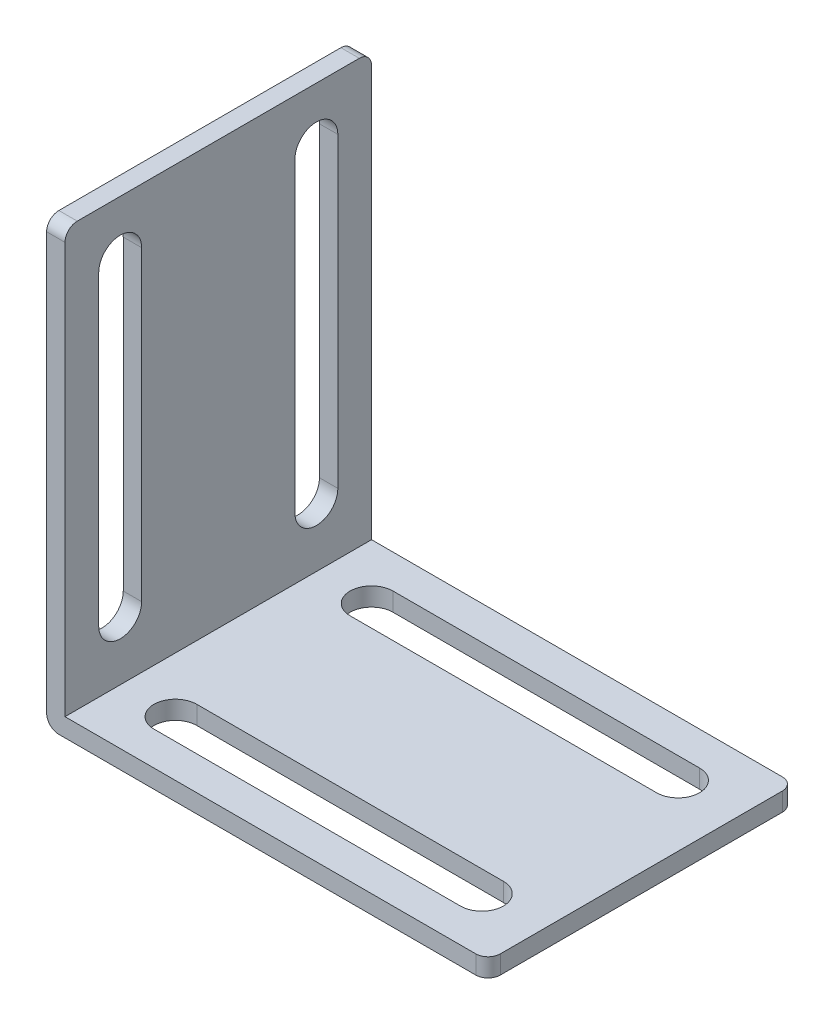
ISO-10303-21;
HEADER;
FILE_DESCRIPTION(('STEP AP214'),'2;1');
FILE_NAME('part.step','',(''),(''),'','','');
FILE_SCHEMA(('AUTOMOTIVE_DESIGN { 1 0 10303 214 1 1 1 1 }'));
ENDSEC;
DATA;
#1=APPLICATION_CONTEXT('core data for automotive mechanical design processes');
#2=APPLICATION_PROTOCOL_DEFINITION('international standard','automotive_design',2000,#1);
#3=PRODUCT_CONTEXT('',#1,'mechanical');
#4=PRODUCT('Part','Part','',(#3));
#5=PRODUCT_RELATED_PRODUCT_CATEGORY('part','',(#4));
#6=PRODUCT_DEFINITION_FORMATION('','',#4);
#7=PRODUCT_DEFINITION_CONTEXT('part definition',#1,'design');
#8=PRODUCT_DEFINITION('design','',#6,#7);
#9=PRODUCT_DEFINITION_SHAPE('','',#8);
#10=(LENGTH_UNIT() NAMED_UNIT(*) SI_UNIT(.MILLI.,.METRE.));
#11=(NAMED_UNIT(*) PLANE_ANGLE_UNIT() SI_UNIT($,.RADIAN.));
#12=(NAMED_UNIT(*) SI_UNIT($,.STERADIAN.) SOLID_ANGLE_UNIT());
#13=UNCERTAINTY_MEASURE_WITH_UNIT(LENGTH_MEASURE(1.E-05),#10,'distance_accuracy_value','');
#14=(GEOMETRIC_REPRESENTATION_CONTEXT(3) GLOBAL_UNCERTAINTY_ASSIGNED_CONTEXT((#13)) GLOBAL_UNIT_ASSIGNED_CONTEXT((#10,
#11,#12)) REPRESENTATION_CONTEXT('',''));
#15=CARTESIAN_POINT('',(0.,0.,0.));
#16=DIRECTION('',(0.,0.,1.));
#17=DIRECTION('',(1.,0.,0.));
#18=AXIS2_PLACEMENT_3D('',#15,#16,#17);
#19=CARTESIAN_POINT('',(0.,0.,0.));
#20=DIRECTION('',(0.,-1.,0.));
#21=DIRECTION('',(0.,0.,-1.));
#22=AXIS2_PLACEMENT_3D('',#19,#20,#21);
#23=PLANE('',#22);
#24=DIRECTION('',(1.,0.,0.));
#25=VECTOR('',#24,1.);
#26=CARTESIAN_POINT('',(0.,0.,-2.75));
#27=LINE('',#26,#25);
#28=CARTESIAN_POINT('',(6.,0.,-2.75));
#29=VERTEX_POINT('',#28);
#30=CARTESIAN_POINT('',(31.,0.,-2.75));
#31=VERTEX_POINT('',#30);
#32=EDGE_CURVE('E324',#29,#31,#27,.T.);
#33=ORIENTED_EDGE('',*,*,#32,.T.);
#34=CARTESIAN_POINT('',(31.,0.,-4.5));
#35=DIRECTION('',(0.,1.,0.));
#36=DIRECTION('',(0.,0.,1.));
#37=AXIS2_PLACEMENT_3D('',#34,#35,#36);
#38=CIRCLE('',#37,1.75);
#39=CARTESIAN_POINT('',(31.,0.,-6.25));
#40=VERTEX_POINT('',#39);
#41=EDGE_CURVE('E327',#31,#40,#38,.T.);
#42=ORIENTED_EDGE('',*,*,#41,.T.);
#43=DIRECTION('',(1.,0.,0.));
#44=VECTOR('',#43,1.);
#45=CARTESIAN_POINT('',(0.,0.,-6.25));
#46=LINE('',#45,#44);
#47=CARTESIAN_POINT('',(6.,0.,-6.25));
#48=VERTEX_POINT('',#47);
#49=EDGE_CURVE('E331',#48,#40,#46,.T.);
#50=ORIENTED_EDGE('',*,*,#49,.F.);
#51=CARTESIAN_POINT('',(6.,0.,-4.5));
#52=DIRECTION('',(0.,1.,0.));
#53=DIRECTION('',(0.,0.,1.));
#54=AXIS2_PLACEMENT_3D('',#51,#52,#53);
#55=CIRCLE('',#54,1.75);
#56=EDGE_CURVE('E334',#48,#29,#55,.T.);
#57=ORIENTED_EDGE('',*,*,#56,.T.);
#58=EDGE_LOOP('',(#33,#42,#50,#57));
#59=FACE_BOUND('',#58,.T.);
#60=DIRECTION('',(-1.,0.,0.));
#61=VECTOR('',#60,1.);
#62=CARTESIAN_POINT('',(0.,0.,-25.));
#63=LINE('',#62,#61);
#64=CARTESIAN_POINT('',(35.,0.,-25.));
#65=VERTEX_POINT('',#64);
#66=CARTESIAN_POINT('',(1.,0.,-25.));
#67=VERTEX_POINT('',#66);
#68=EDGE_CURVE('E412',#65,#67,#63,.T.);
#69=ORIENTED_EDGE('',*,*,#68,.F.);
#70=CARTESIAN_POINT('',(35.,0.,-24.));
#71=DIRECTION('',(0.,-1.,0.));
#72=DIRECTION('',(0.,0.,-1.));
#73=AXIS2_PLACEMENT_3D('',#70,#71,#72);
#74=CIRCLE('',#73,1.);
#75=CARTESIAN_POINT('',(36.,0.,-24.));
#76=VERTEX_POINT('',#75);
#77=EDGE_CURVE('E459',#65,#76,#74,.T.);
#78=ORIENTED_EDGE('',*,*,#77,.T.);
#79=DIRECTION('',(0.,0.,-1.));
#80=VECTOR('',#79,1.);
#81=CARTESIAN_POINT('',(36.,0.,0.));
#82=LINE('',#81,#80);
#83=CARTESIAN_POINT('',(36.,0.,-1.));
#84=VERTEX_POINT('',#83);
#85=EDGE_CURVE('E415',#84,#76,#82,.T.);
#86=ORIENTED_EDGE('',*,*,#85,.F.);
#87=CARTESIAN_POINT('',(35.,0.,-1.));
#88=DIRECTION('',(0.,-1.,0.));
#89=DIRECTION('',(0.,0.,-1.));
#90=AXIS2_PLACEMENT_3D('',#87,#88,#89);
#91=CIRCLE('',#90,1.);
#92=CARTESIAN_POINT('',(35.,0.,0.));
#93=VERTEX_POINT('',#92);
#94=EDGE_CURVE('E457',#84,#93,#91,.T.);
#95=ORIENTED_EDGE('',*,*,#94,.T.);
#96=DIRECTION('',(1.,0.,0.));
#97=VECTOR('',#96,1.);
#98=CARTESIAN_POINT('',(0.,0.,0.));
#99=LINE('',#98,#97);
#100=CARTESIAN_POINT('',(1.,0.,0.));
#101=VERTEX_POINT('',#100);
#102=EDGE_CURVE('E405',#101,#93,#99,.T.);
#103=ORIENTED_EDGE('',*,*,#102,.F.);
#104=DIRECTION('',(0.,0.,1.));
#105=VECTOR('',#104,1.);
#106=CARTESIAN_POINT('',(1.,0.,-25.));
#107=LINE('',#106,#105);
#108=EDGE_CURVE('E455',#101,#67,#107,.F.);
#109=ORIENTED_EDGE('',*,*,#108,.T.);
#110=EDGE_LOOP('',(#69,#78,#86,#95,#103,#109));
#111=FACE_BOUND('',#110,.T.);
#112=CARTESIAN_POINT('',(30.9999999999999,0.,-20.5));
#113=DIRECTION('',(0.,1.,0.));
#114=DIRECTION('',(0.,0.,1.));
#115=AXIS2_PLACEMENT_3D('',#112,#113,#114);
#116=CIRCLE('',#115,1.75);
#117=CARTESIAN_POINT('',(30.9999999999999,0.,-18.75));
#118=VERTEX_POINT('',#117);
#119=CARTESIAN_POINT('',(30.9999999999999,0.,-22.25));
#120=VERTEX_POINT('',#119);
#121=EDGE_CURVE('E383',#118,#120,#116,.T.);
#122=ORIENTED_EDGE('',*,*,#121,.T.);
#123=DIRECTION('',(1.,0.,0.));
#124=VECTOR('',#123,1.);
#125=CARTESIAN_POINT('',(0.,0.,-22.25));
#126=LINE('',#125,#124);
#127=CARTESIAN_POINT('',(5.99999999999994,0.,-22.25));
#128=VERTEX_POINT('',#127);
#129=EDGE_CURVE('E366',#128,#120,#126,.T.);
#130=ORIENTED_EDGE('',*,*,#129,.F.);
#131=CARTESIAN_POINT('',(5.99999999999994,0.,-20.5));
#132=DIRECTION('',(0.,1.,0.));
#133=DIRECTION('',(0.,0.,1.));
#134=AXIS2_PLACEMENT_3D('',#131,#132,#133);
#135=CIRCLE('',#134,1.75);
#136=CARTESIAN_POINT('',(5.99999999999994,0.,-18.75));
#137=VERTEX_POINT('',#136);
#138=EDGE_CURVE('E360',#128,#137,#135,.T.);
#139=ORIENTED_EDGE('',*,*,#138,.T.);
#140=DIRECTION('',(1.,0.,0.));
#141=VECTOR('',#140,1.);
#142=CARTESIAN_POINT('',(0.,0.,-18.75));
#143=LINE('',#142,#141);
#144=EDGE_CURVE('E377',#137,#118,#143,.T.);
#145=ORIENTED_EDGE('',*,*,#144,.T.);
#146=EDGE_LOOP('',(#122,#130,#139,#145));
#147=FACE_BOUND('',#146,.T.);
#148=ADVANCED_FACE('F75',(#59,#111,#147),#23,.T.);
#149=CARTESIAN_POINT('',(0.,1.49999999999999,0.));
#150=DIRECTION('',(0.,1.,0.));
#151=DIRECTION('',(0.,0.,1.));
#152=AXIS2_PLACEMENT_3D('',#149,#150,#151);
#153=PLANE('',#152);
#154=DIRECTION('',(1.,0.,0.));
#155=VECTOR('',#154,1.);
#156=CARTESIAN_POINT('',(0.,1.49999999999999,-2.75));
#157=LINE('',#156,#155);
#158=CARTESIAN_POINT('',(6.,1.49999999999999,-2.75));
#159=VERTEX_POINT('',#158);
#160=CARTESIAN_POINT('',(31.,1.49999999999999,-2.75));
#161=VERTEX_POINT('',#160);
#162=EDGE_CURVE('E338',#159,#161,#157,.T.);
#163=ORIENTED_EDGE('',*,*,#162,.F.);
#164=CARTESIAN_POINT('',(6.,1.49999999999999,-4.5));
#165=DIRECTION('',(0.,1.,0.));
#166=DIRECTION('',(0.,0.,1.));
#167=AXIS2_PLACEMENT_3D('',#164,#165,#166);
#168=CIRCLE('',#167,1.75);
#169=CARTESIAN_POINT('',(6.,1.49999999999999,-6.25));
#170=VERTEX_POINT('',#169);
#171=EDGE_CURVE('E328',#170,#159,#168,.T.);
#172=ORIENTED_EDGE('',*,*,#171,.F.);
#173=DIRECTION('',(1.,0.,0.));
#174=VECTOR('',#173,1.);
#175=CARTESIAN_POINT('',(0.,1.49999999999999,-6.25));
#176=LINE('',#175,#174);
#177=CARTESIAN_POINT('',(31.,1.49999999999999,-6.25));
#178=VERTEX_POINT('',#177);
#179=EDGE_CURVE('E344',#170,#178,#176,.T.);
#180=ORIENTED_EDGE('',*,*,#179,.T.);
#181=CARTESIAN_POINT('',(31.,1.49999999999999,-4.5));
#182=DIRECTION('',(0.,1.,0.));
#183=DIRECTION('',(0.,0.,1.));
#184=AXIS2_PLACEMENT_3D('',#181,#182,#183);
#185=CIRCLE('',#184,1.75);
#186=EDGE_CURVE('E340',#161,#178,#185,.T.);
#187=ORIENTED_EDGE('',*,*,#186,.F.);
#188=EDGE_LOOP('',(#163,#172,#180,#187));
#189=FACE_BOUND('',#188,.T.);
#190=DIRECTION('',(0.,0.,-1.));
#191=VECTOR('',#190,1.);
#192=CARTESIAN_POINT('',(36.,1.49999999999999,-25.));
#193=LINE('',#192,#191);
#194=CARTESIAN_POINT('',(36.,1.49999999999999,-1.));
#195=VERTEX_POINT('',#194);
#196=CARTESIAN_POINT('',(36.,1.49999999999999,-24.));
#197=VERTEX_POINT('',#196);
#198=EDGE_CURVE('E394',#195,#197,#193,.T.);
#199=ORIENTED_EDGE('',*,*,#198,.T.);
#200=CARTESIAN_POINT('',(35.,1.49999999999999,-24.));
#201=DIRECTION('',(0.,1.,0.));
#202=DIRECTION('',(0.,0.,1.));
#203=AXIS2_PLACEMENT_3D('',#200,#201,#202);
#204=CIRCLE('',#203,1.);
#205=CARTESIAN_POINT('',(35.,1.49999999999999,-25.));
#206=VERTEX_POINT('',#205);
#207=EDGE_CURVE('E14',#197,#206,#204,.T.);
#208=ORIENTED_EDGE('',*,*,#207,.T.);
#209=DIRECTION('',(-1.,0.,0.));
#210=VECTOR('',#209,1.);
#211=CARTESIAN_POINT('',(1.5,1.49999999999999,-25.));
#212=LINE('',#211,#210);
#213=CARTESIAN_POINT('',(1.5,1.49999999999999,-25.));
#214=VERTEX_POINT('',#213);
#215=EDGE_CURVE('E397',#206,#214,#212,.T.);
#216=ORIENTED_EDGE('',*,*,#215,.T.);
#217=DIRECTION('',(0.,0.,1.));
#218=VECTOR('',#217,1.);
#219=CARTESIAN_POINT('',(1.5,1.49999999999999,-25.));
#220=LINE('',#219,#218);
#221=CARTESIAN_POINT('',(1.5,1.49999999999999,0.));
#222=VERTEX_POINT('',#221);
#223=EDGE_CURVE('E388',#214,#222,#220,.T.);
#224=ORIENTED_EDGE('',*,*,#223,.T.);
#225=DIRECTION('',(1.,0.,0.));
#226=VECTOR('',#225,1.);
#227=CARTESIAN_POINT('',(1.5,1.49999999999999,0.));
#228=LINE('',#227,#226);
#229=CARTESIAN_POINT('',(35.,1.49999999999999,0.));
#230=VERTEX_POINT('',#229);
#231=EDGE_CURVE('E391',#222,#230,#228,.T.);
#232=ORIENTED_EDGE('',*,*,#231,.T.);
#233=CARTESIAN_POINT('',(35.,1.49999999999999,-1.));
#234=DIRECTION('',(0.,1.,0.));
#235=DIRECTION('',(0.,0.,1.));
#236=AXIS2_PLACEMENT_3D('',#233,#234,#235);
#237=CIRCLE('',#236,1.);
#238=EDGE_CURVE('E83',#230,#195,#237,.T.);
#239=ORIENTED_EDGE('',*,*,#238,.T.);
#240=EDGE_LOOP('',(#199,#208,#216,#224,#232,#239));
#241=FACE_BOUND('',#240,.T.);
#242=CARTESIAN_POINT('',(5.99999999999994,1.49999999999999,-20.5));
#243=DIRECTION('',(0.,1.,0.));
#244=DIRECTION('',(0.,0.,1.));
#245=AXIS2_PLACEMENT_3D('',#242,#243,#244);
#246=CIRCLE('',#245,1.75);
#247=CARTESIAN_POINT('',(5.99999999999994,1.49999999999999,-22.25));
#248=VERTEX_POINT('',#247);
#249=CARTESIAN_POINT('',(5.99999999999994,1.49999999999999,-18.75));
#250=VERTEX_POINT('',#249);
#251=EDGE_CURVE('E341',#248,#250,#246,.T.);
#252=ORIENTED_EDGE('',*,*,#251,.F.);
#253=DIRECTION('',(1.,0.,0.));
#254=VECTOR('',#253,1.);
#255=CARTESIAN_POINT('',(0.,1.49999999999999,-22.25));
#256=LINE('',#255,#254);
#257=CARTESIAN_POINT('',(30.9999999999999,1.49999999999999,-22.25));
#258=VERTEX_POINT('',#257);
#259=EDGE_CURVE('E373',#248,#258,#256,.T.);
#260=ORIENTED_EDGE('',*,*,#259,.T.);
#261=CARTESIAN_POINT('',(30.9999999999999,1.49999999999999,-20.5));
#262=DIRECTION('',(0.,1.,0.));
#263=DIRECTION('',(0.,0.,1.));
#264=AXIS2_PLACEMENT_3D('',#261,#262,#263);
#265=CIRCLE('',#264,1.75);
#266=CARTESIAN_POINT('',(30.9999999999999,1.49999999999999,-18.75));
#267=VERTEX_POINT('',#266);
#268=EDGE_CURVE('E376',#267,#258,#265,.T.);
#269=ORIENTED_EDGE('',*,*,#268,.F.);
#270=DIRECTION('',(1.,0.,0.));
#271=VECTOR('',#270,1.);
#272=CARTESIAN_POINT('',(0.,1.49999999999999,-18.75));
#273=LINE('',#272,#271);
#274=EDGE_CURVE('E363',#250,#267,#273,.T.);
#275=ORIENTED_EDGE('',*,*,#274,.F.);
#276=EDGE_LOOP('',(#252,#260,#269,#275));
#277=FACE_BOUND('',#276,.T.);
#278=ADVANCED_FACE('F468',(#189,#241,#277),#153,.T.);
#279=CARTESIAN_POINT('',(36.,36.,0.));
#280=DIRECTION('',(-1.,0.,0.));
#281=DIRECTION('',(0.,0.,1.));
#282=AXIS2_PLACEMENT_3D('',#279,#280,#281);
#283=PLANE('',#282);
#284=ORIENTED_EDGE('',*,*,#85,.T.);
#285=DIRECTION('',(0.,-1.,0.));
#286=VECTOR('',#285,1.);
#287=CARTESIAN_POINT('',(36.,36.,-24.));
#288=LINE('',#287,#286);
#289=EDGE_CURVE('E464',#76,#197,#288,.F.);
#290=ORIENTED_EDGE('',*,*,#289,.T.);
#291=ORIENTED_EDGE('',*,*,#198,.F.);
#292=DIRECTION('',(0.,-1.,0.));
#293=VECTOR('',#292,1.);
#294=CARTESIAN_POINT('',(36.,36.,-1.));
#295=LINE('',#294,#293);
#296=EDGE_CURVE('E461',#195,#84,#295,.T.);
#297=ORIENTED_EDGE('',*,*,#296,.T.);
#298=EDGE_LOOP('',(#284,#290,#291,#297));
#299=FACE_BOUND('',#298,.T.);
#300=ADVANCED_FACE('F476',(#299),#283,.F.);
#301=CARTESIAN_POINT('',(0.,36.,0.));
#302=DIRECTION('',(1.,0.,0.));
#303=DIRECTION('',(0.,0.,-1.));
#304=AXIS2_PLACEMENT_3D('',#301,#302,#303);
#305=PLANE('',#304);
#306=DIRECTION('',(0.,-1.,0.));
#307=VECTOR('',#306,1.);
#308=CARTESIAN_POINT('',(0.,2.31585584042907E-13,-22.2500000000003));
#309=LINE('',#308,#307);
#310=CARTESIAN_POINT('',(0.,31.5,-22.25));
#311=VERTEX_POINT('',#310);
#312=CARTESIAN_POINT('',(0.,6.5,-22.2500000000003));
#313=VERTEX_POINT('',#312);
#314=EDGE_CURVE('E266',#311,#313,#309,.T.);
#315=ORIENTED_EDGE('',*,*,#314,.F.);
#316=CARTESIAN_POINT('',(0.,31.5,-20.5));
#317=DIRECTION('',(1.,0.,0.));
#318=DIRECTION('',(0.,0.,-1.));
#319=AXIS2_PLACEMENT_3D('',#316,#317,#318);
#320=CIRCLE('',#319,1.75);
#321=CARTESIAN_POINT('',(0.,31.5,-18.75));
#322=VERTEX_POINT('',#321);
#323=EDGE_CURVE('E258',#311,#322,#320,.T.);
#324=ORIENTED_EDGE('',*,*,#323,.T.);
#325=DIRECTION('',(0.,-1.,0.));
#326=VECTOR('',#325,1.);
#327=CARTESIAN_POINT('',(0.,1.95156391047394E-13,-18.7500000000003));
#328=LINE('',#327,#326);
#329=CARTESIAN_POINT('',(0.,6.5,-18.7500000000003));
#330=VERTEX_POINT('',#329);
#331=EDGE_CURVE('E269',#322,#330,#328,.T.);
#332=ORIENTED_EDGE('',*,*,#331,.T.);
#333=CARTESIAN_POINT('',(0.,6.5,-20.5000000000003));
#334=DIRECTION('',(1.,0.,0.));
#335=DIRECTION('',(0.,0.,-1.));
#336=AXIS2_PLACEMENT_3D('',#333,#334,#335);
#337=CIRCLE('',#336,1.75);
#338=EDGE_CURVE('E90',#330,#313,#337,.T.);
#339=ORIENTED_EDGE('',*,*,#338,.T.);
#340=EDGE_LOOP('',(#315,#324,#332,#339));
#341=FACE_BOUND('',#340,.T.);
#342=CARTESIAN_POINT('',(0.,31.5,-4.5));
#343=DIRECTION('',(1.,0.,0.));
#344=DIRECTION('',(0.,0.,-1.));
#345=AXIS2_PLACEMENT_3D('',#342,#343,#344);
#346=CIRCLE('',#345,1.75);
#347=CARTESIAN_POINT('',(0.,31.5,-6.25));
#348=VERTEX_POINT('',#347);
#349=CARTESIAN_POINT('',(0.,31.5,-2.75));
#350=VERTEX_POINT('',#349);
#351=EDGE_CURVE('E320',#348,#350,#346,.T.);
#352=ORIENTED_EDGE('',*,*,#351,.T.);
#353=DIRECTION('',(0.,-1.,0.));
#354=VECTOR('',#353,1.);
#355=CARTESIAN_POINT('',(0.,0.,-2.75000000000033));
#356=LINE('',#355,#354);
#357=CARTESIAN_POINT('',(0.,6.5,-2.75000000000026));
#358=VERTEX_POINT('',#357);
#359=EDGE_CURVE('E303',#350,#358,#356,.T.);
#360=ORIENTED_EDGE('',*,*,#359,.T.);
#361=CARTESIAN_POINT('',(0.,6.5,-4.50000000000026));
#362=DIRECTION('',(1.,0.,0.));
#363=DIRECTION('',(0.,0.,-1.));
#364=AXIS2_PLACEMENT_3D('',#361,#362,#363);
#365=CIRCLE('',#364,1.75);
#366=CARTESIAN_POINT('',(0.,6.5,-6.25000000000026));
#367=VERTEX_POINT('',#366);
#368=EDGE_CURVE('E297',#358,#367,#365,.T.);
#369=ORIENTED_EDGE('',*,*,#368,.T.);
#370=DIRECTION('',(0.,-1.,0.));
#371=VECTOR('',#370,1.);
#372=CARTESIAN_POINT('',(0.,0.,-6.25000000000033));
#373=LINE('',#372,#371);
#374=EDGE_CURVE('E98',#348,#367,#373,.T.);
#375=ORIENTED_EDGE('',*,*,#374,.F.);
#376=EDGE_LOOP('',(#352,#360,#369,#375));
#377=FACE_BOUND('',#376,.T.);
#378=DIRECTION('',(0.,-1.,0.));
#379=VECTOR('',#378,1.);
#380=CARTESIAN_POINT('',(0.,36.,0.));
#381=LINE('',#380,#379);
#382=CARTESIAN_POINT('',(0.,35.,0.));
#383=VERTEX_POINT('',#382);
#384=CARTESIAN_POINT('',(0.,1.,0.));
#385=VERTEX_POINT('',#384);
#386=EDGE_CURVE('E422',#383,#385,#381,.T.);
#387=ORIENTED_EDGE('',*,*,#386,.F.);
#388=CARTESIAN_POINT('',(0.,35.,-1.));
#389=DIRECTION('',(1.,0.,0.));
#390=DIRECTION('',(0.,0.,-1.));
#391=AXIS2_PLACEMENT_3D('',#388,#389,#390);
#392=CIRCLE('',#391,1.);
#393=CARTESIAN_POINT('',(0.,36.,-1.));
#394=VERTEX_POINT('',#393);
#395=EDGE_CURVE('E446',#383,#394,#392,.F.);
#396=ORIENTED_EDGE('',*,*,#395,.T.);
#397=DIRECTION('',(0.,0.,1.));
#398=VECTOR('',#397,1.);
#399=CARTESIAN_POINT('',(0.,36.,0.));
#400=LINE('',#399,#398);
#401=CARTESIAN_POINT('',(0.,36.,-24.));
#402=VERTEX_POINT('',#401);
#403=EDGE_CURVE('E408',#402,#394,#400,.T.);
#404=ORIENTED_EDGE('',*,*,#403,.F.);
#405=CARTESIAN_POINT('',(0.,35.,-24.));
#406=DIRECTION('',(1.,0.,0.));
#407=DIRECTION('',(0.,0.,-1.));
#408=AXIS2_PLACEMENT_3D('',#405,#406,#407);
#409=CIRCLE('',#408,1.);
#410=CARTESIAN_POINT('',(0.,35.,-25.));
#411=VERTEX_POINT('',#410);
#412=EDGE_CURVE('E444',#402,#411,#409,.F.);
#413=ORIENTED_EDGE('',*,*,#412,.T.);
#414=DIRECTION('',(0.,-1.,0.));
#415=VECTOR('',#414,1.);
#416=CARTESIAN_POINT('',(0.,36.,-25.));
#417=LINE('',#416,#415);
#418=CARTESIAN_POINT('',(0.,1.,-25.));
#419=VERTEX_POINT('',#418);
#420=EDGE_CURVE('E411',#411,#419,#417,.T.);
#421=ORIENTED_EDGE('',*,*,#420,.T.);
#422=DIRECTION('',(0.,0.,1.));
#423=VECTOR('',#422,1.);
#424=CARTESIAN_POINT('',(0.,1.,0.));
#425=LINE('',#424,#423);
#426=EDGE_CURVE('E441',#419,#385,#425,.T.);
#427=ORIENTED_EDGE('',*,*,#426,.T.);
#428=EDGE_LOOP('',(#387,#396,#404,#413,#421,#427));
#429=FACE_BOUND('',#428,.T.);
#430=ADVANCED_FACE('F273',(#341,#377,#429),#305,.F.);
#431=CARTESIAN_POINT('',(0.,36.,0.));
#432=DIRECTION('',(0.,0.,-1.));
#433=DIRECTION('',(-1.,0.,0.));
#434=AXIS2_PLACEMENT_3D('',#431,#432,#433);
#435=PLANE('',#434);
#436=DIRECTION('',(0.,1.,0.));
#437=VECTOR('',#436,1.);
#438=CARTESIAN_POINT('',(1.5,1.49999999999999,0.));
#439=LINE('',#438,#437);
#440=CARTESIAN_POINT('',(1.5,35.,0.));
#441=VERTEX_POINT('',#440);
#442=EDGE_CURVE('E399',#222,#441,#439,.T.);
#443=ORIENTED_EDGE('',*,*,#442,.T.);
#444=DIRECTION('',(1.,0.,0.));
#445=VECTOR('',#444,1.);
#446=CARTESIAN_POINT('',(0.,35.,0.));
#447=LINE('',#446,#445);
#448=EDGE_CURVE('E439',#441,#383,#447,.F.);
#449=ORIENTED_EDGE('',*,*,#448,.T.);
#450=ORIENTED_EDGE('',*,*,#386,.T.);
#451=CARTESIAN_POINT('',(1.,1.,0.));
#452=DIRECTION('',(0.,0.,-1.));
#453=DIRECTION('',(-1.,0.,0.));
#454=AXIS2_PLACEMENT_3D('',#451,#452,#453);
#455=CIRCLE('',#454,1.);
#456=EDGE_CURVE('E435',#385,#101,#455,.F.);
#457=ORIENTED_EDGE('',*,*,#456,.T.);
#458=ORIENTED_EDGE('',*,*,#102,.T.);
#459=DIRECTION('',(0.,-1.,0.));
#460=VECTOR('',#459,1.);
#461=CARTESIAN_POINT('',(35.,36.,0.));
#462=LINE('',#461,#460);
#463=EDGE_CURVE('E437',#93,#230,#462,.F.);
#464=ORIENTED_EDGE('',*,*,#463,.T.);
#465=ORIENTED_EDGE('',*,*,#231,.F.);
#466=EDGE_LOOP('',(#443,#449,#450,#457,#458,#464,#465));
#467=FACE_BOUND('',#466,.T.);
#468=ADVANCED_FACE('F486',(#467),#435,.F.);
#469=CARTESIAN_POINT('',(0.,36.,-25.));
#470=DIRECTION('',(0.,0.,1.));
#471=DIRECTION('',(1.,0.,0.));
#472=AXIS2_PLACEMENT_3D('',#469,#470,#471);
#473=PLANE('',#472);
#474=ORIENTED_EDGE('',*,*,#420,.F.);
#475=DIRECTION('',(-1.,0.,0.));
#476=VECTOR('',#475,1.);
#477=CARTESIAN_POINT('',(0.,35.,-25.));
#478=LINE('',#477,#476);
#479=CARTESIAN_POINT('',(1.5,35.,-25.));
#480=VERTEX_POINT('',#479);
#481=EDGE_CURVE('E453',#411,#480,#478,.F.);
#482=ORIENTED_EDGE('',*,*,#481,.T.);
#483=DIRECTION('',(0.,1.,0.));
#484=VECTOR('',#483,1.);
#485=CARTESIAN_POINT('',(1.5,1.49999999999999,-25.));
#486=LINE('',#485,#484);
#487=EDGE_CURVE('E402',#214,#480,#486,.T.);
#488=ORIENTED_EDGE('',*,*,#487,.F.);
#489=ORIENTED_EDGE('',*,*,#215,.F.);
#490=DIRECTION('',(0.,-1.,0.));
#491=VECTOR('',#490,1.);
#492=CARTESIAN_POINT('',(35.,36.,-25.));
#493=LINE('',#492,#491);
#494=EDGE_CURVE('E450',#206,#65,#493,.T.);
#495=ORIENTED_EDGE('',*,*,#494,.T.);
#496=ORIENTED_EDGE('',*,*,#68,.T.);
#497=CARTESIAN_POINT('',(1.,1.,-25.));
#498=DIRECTION('',(0.,0.,1.));
#499=DIRECTION('',(1.,0.,0.));
#500=AXIS2_PLACEMENT_3D('',#497,#498,#499);
#501=CIRCLE('',#500,1.);
#502=EDGE_CURVE('E448',#67,#419,#501,.F.);
#503=ORIENTED_EDGE('',*,*,#502,.T.);
#504=EDGE_LOOP('',(#474,#482,#488,#489,#495,#496,#503));
#505=FACE_BOUND('',#504,.T.);
#506=ADVANCED_FACE('F497',(#505),#473,.F.);
#507=CARTESIAN_POINT('',(0.,36.,0.));
#508=DIRECTION('',(0.,-1.,0.));
#509=DIRECTION('',(0.,0.,-1.));
#510=AXIS2_PLACEMENT_3D('',#507,#508,#509);
#511=PLANE('',#510);
#512=ORIENTED_EDGE('',*,*,#403,.T.);
#513=DIRECTION('',(1.,0.,0.));
#514=VECTOR('',#513,1.);
#515=CARTESIAN_POINT('',(0.,36.,-1.));
#516=LINE('',#515,#514);
#517=CARTESIAN_POINT('',(1.5,36.,-1.));
#518=VERTEX_POINT('',#517);
#519=EDGE_CURVE('E428',#394,#518,#516,.T.);
#520=ORIENTED_EDGE('',*,*,#519,.T.);
#521=DIRECTION('',(0.,0.,1.));
#522=VECTOR('',#521,1.);
#523=CARTESIAN_POINT('',(1.5,36.,-25.));
#524=LINE('',#523,#522);
#525=CARTESIAN_POINT('',(1.5,36.,-24.));
#526=VERTEX_POINT('',#525);
#527=EDGE_CURVE('E351',#526,#518,#524,.T.);
#528=ORIENTED_EDGE('',*,*,#527,.F.);
#529=DIRECTION('',(-1.,0.,0.));
#530=VECTOR('',#529,1.);
#531=CARTESIAN_POINT('',(0.,36.,-24.));
#532=LINE('',#531,#530);
#533=EDGE_CURVE('E425',#526,#402,#532,.T.);
#534=ORIENTED_EDGE('',*,*,#533,.T.);
#535=EDGE_LOOP('',(#512,#520,#528,#534));
#536=FACE_BOUND('',#535,.T.);
#537=ADVANCED_FACE('F508',(#536),#511,.F.);
#538=CARTESIAN_POINT('',(1.5,1.49999999999999,-25.));
#539=DIRECTION('',(-1.,0.,0.));
#540=DIRECTION('',(0.,0.,1.));
#541=AXIS2_PLACEMENT_3D('',#538,#539,#540);
#542=PLANE('',#541);
#543=DIRECTION('',(0.,-1.,0.));
#544=VECTOR('',#543,1.);
#545=CARTESIAN_POINT('',(1.5,1.95156391047394E-13,-18.7500000000003));
#546=LINE('',#545,#544);
#547=CARTESIAN_POINT('',(1.5,31.5,-18.75));
#548=VERTEX_POINT('',#547);
#549=CARTESIAN_POINT('',(1.5,6.5,-18.7500000000003));
#550=VERTEX_POINT('',#549);
#551=EDGE_CURVE('E284',#548,#550,#546,.T.);
#552=ORIENTED_EDGE('',*,*,#551,.F.);
#553=CARTESIAN_POINT('',(1.5,31.5,-20.5));
#554=DIRECTION('',(1.,0.,0.));
#555=DIRECTION('',(0.,0.,-1.));
#556=AXIS2_PLACEMENT_3D('',#553,#554,#555);
#557=CIRCLE('',#556,1.75);
#558=CARTESIAN_POINT('',(1.5,31.5,-22.25));
#559=VERTEX_POINT('',#558);
#560=EDGE_CURVE('E261',#559,#548,#557,.T.);
#561=ORIENTED_EDGE('',*,*,#560,.F.);
#562=DIRECTION('',(0.,-1.,0.));
#563=VECTOR('',#562,1.);
#564=CARTESIAN_POINT('',(1.5,2.31585584042907E-13,-22.2500000000003));
#565=LINE('',#564,#563);
#566=CARTESIAN_POINT('',(1.5,6.5,-22.2500000000003));
#567=VERTEX_POINT('',#566);
#568=EDGE_CURVE('E275',#559,#567,#565,.T.);
#569=ORIENTED_EDGE('',*,*,#568,.T.);
#570=CARTESIAN_POINT('',(1.5,6.5,-20.5000000000003));
#571=DIRECTION('',(1.,0.,0.));
#572=DIRECTION('',(0.,0.,-1.));
#573=AXIS2_PLACEMENT_3D('',#570,#571,#572);
#574=CIRCLE('',#573,1.75);
#575=EDGE_CURVE('E278',#550,#567,#574,.T.);
#576=ORIENTED_EDGE('',*,*,#575,.F.);
#577=EDGE_LOOP('',(#552,#561,#569,#576));
#578=FACE_BOUND('',#577,.T.);
#579=CARTESIAN_POINT('',(1.5,6.5,-4.50000000000026));
#580=DIRECTION('',(1.,0.,0.));
#581=DIRECTION('',(0.,0.,-1.));
#582=AXIS2_PLACEMENT_3D('',#579,#580,#581);
#583=CIRCLE('',#582,1.75);
#584=CARTESIAN_POINT('',(1.5,6.5,-2.75000000000026));
#585=VERTEX_POINT('',#584);
#586=CARTESIAN_POINT('',(1.5,6.5,-6.25000000000026));
#587=VERTEX_POINT('',#586);
#588=EDGE_CURVE('E285',#585,#587,#583,.T.);
#589=ORIENTED_EDGE('',*,*,#588,.F.);
#590=DIRECTION('',(0.,-1.,0.));
#591=VECTOR('',#590,1.);
#592=CARTESIAN_POINT('',(1.5,0.,-2.75000000000033));
#593=LINE('',#592,#591);
#594=CARTESIAN_POINT('',(1.5,31.5,-2.75));
#595=VERTEX_POINT('',#594);
#596=EDGE_CURVE('E311',#595,#585,#593,.T.);
#597=ORIENTED_EDGE('',*,*,#596,.F.);
#598=CARTESIAN_POINT('',(1.5,31.5,-4.5));
#599=DIRECTION('',(1.,0.,0.));
#600=DIRECTION('',(0.,0.,-1.));
#601=AXIS2_PLACEMENT_3D('',#598,#599,#600);
#602=CIRCLE('',#601,1.75);
#603=CARTESIAN_POINT('',(1.5,31.5,-6.25));
#604=VERTEX_POINT('',#603);
#605=EDGE_CURVE('E313',#604,#595,#602,.T.);
#606=ORIENTED_EDGE('',*,*,#605,.F.);
#607=DIRECTION('',(0.,-1.,0.));
#608=VECTOR('',#607,1.);
#609=CARTESIAN_POINT('',(1.5,0.,-6.25000000000033));
#610=LINE('',#609,#608);
#611=EDGE_CURVE('E300',#604,#587,#610,.T.);
#612=ORIENTED_EDGE('',*,*,#611,.T.);
#613=EDGE_LOOP('',(#589,#597,#606,#612));
#614=FACE_BOUND('',#613,.T.);
#615=ORIENTED_EDGE('',*,*,#527,.T.);
#616=CARTESIAN_POINT('',(1.5,35.,-1.));
#617=DIRECTION('',(-1.,0.,0.));
#618=DIRECTION('',(0.,0.,1.));
#619=AXIS2_PLACEMENT_3D('',#616,#617,#618);
#620=CIRCLE('',#619,1.);
#621=EDGE_CURVE('E433',#518,#441,#620,.F.);
#622=ORIENTED_EDGE('',*,*,#621,.T.);
#623=ORIENTED_EDGE('',*,*,#442,.F.);
#624=ORIENTED_EDGE('',*,*,#223,.F.);
#625=ORIENTED_EDGE('',*,*,#487,.T.);
#626=CARTESIAN_POINT('',(1.5,35.,-24.));
#627=DIRECTION('',(-1.,0.,0.));
#628=DIRECTION('',(0.,0.,1.));
#629=AXIS2_PLACEMENT_3D('',#626,#627,#628);
#630=CIRCLE('',#629,1.);
#631=EDGE_CURVE('E431',#480,#526,#630,.F.);
#632=ORIENTED_EDGE('',*,*,#631,.T.);
#633=EDGE_LOOP('',(#615,#622,#623,#624,#625,#632));
#634=FACE_BOUND('',#633,.T.);
#635=ADVANCED_FACE('F505',(#578,#614,#634),#542,.F.);
#636=CARTESIAN_POINT('',(0.,35.,-1.));
#637=DIRECTION('',(1.,0.,0.));
#638=DIRECTION('',(0.,0.,-1.));
#639=AXIS2_PLACEMENT_3D('',#636,#637,#638);
#640=CYLINDRICAL_SURFACE('',#639,1.);
#641=ORIENTED_EDGE('',*,*,#395,.F.);
#642=ORIENTED_EDGE('',*,*,#448,.F.);
#643=ORIENTED_EDGE('',*,*,#621,.F.);
#644=ORIENTED_EDGE('',*,*,#519,.F.);
#645=EDGE_LOOP('',(#641,#642,#643,#644));
#646=FACE_BOUND('',#645,.T.);
#647=ADVANCED_FACE('F511',(#646),#640,.T.);
#648=CARTESIAN_POINT('',(0.,35.,-24.));
#649=DIRECTION('',(-1.,0.,0.));
#650=DIRECTION('',(0.,0.,1.));
#651=AXIS2_PLACEMENT_3D('',#648,#649,#650);
#652=CYLINDRICAL_SURFACE('',#651,1.);
#653=ORIENTED_EDGE('',*,*,#631,.F.);
#654=ORIENTED_EDGE('',*,*,#481,.F.);
#655=ORIENTED_EDGE('',*,*,#412,.F.);
#656=ORIENTED_EDGE('',*,*,#533,.F.);
#657=EDGE_LOOP('',(#653,#654,#655,#656));
#658=FACE_BOUND('',#657,.T.);
#659=ADVANCED_FACE('F501',(#658),#652,.T.);
#660=CARTESIAN_POINT('',(35.,36.,-24.));
#661=DIRECTION('',(0.,-1.,0.));
#662=DIRECTION('',(0.,0.,-1.));
#663=AXIS2_PLACEMENT_3D('',#660,#661,#662);
#664=CYLINDRICAL_SURFACE('',#663,1.);
#665=ORIENTED_EDGE('',*,*,#207,.F.);
#666=ORIENTED_EDGE('',*,*,#289,.F.);
#667=ORIENTED_EDGE('',*,*,#77,.F.);
#668=ORIENTED_EDGE('',*,*,#494,.F.);
#669=EDGE_LOOP('',(#665,#666,#667,#668));
#670=FACE_BOUND('',#669,.T.);
#671=ADVANCED_FACE('F516',(#670),#664,.T.);
#672=CARTESIAN_POINT('',(35.,36.,-1.));
#673=DIRECTION('',(0.,-1.,0.));
#674=DIRECTION('',(0.,0.,-1.));
#675=AXIS2_PLACEMENT_3D('',#672,#673,#674);
#676=CYLINDRICAL_SURFACE('',#675,1.);
#677=ORIENTED_EDGE('',*,*,#238,.F.);
#678=ORIENTED_EDGE('',*,*,#463,.F.);
#679=ORIENTED_EDGE('',*,*,#94,.F.);
#680=ORIENTED_EDGE('',*,*,#296,.F.);
#681=EDGE_LOOP('',(#677,#678,#679,#680));
#682=FACE_BOUND('',#681,.T.);
#683=ADVANCED_FACE('F479',(#682),#676,.T.);
#684=CARTESIAN_POINT('',(1.,1.,0.));
#685=DIRECTION('',(0.,0.,-1.));
#686=DIRECTION('',(-1.,0.,0.));
#687=AXIS2_PLACEMENT_3D('',#684,#685,#686);
#688=CYLINDRICAL_SURFACE('',#687,1.);
#689=ORIENTED_EDGE('',*,*,#502,.F.);
#690=ORIENTED_EDGE('',*,*,#108,.F.);
#691=ORIENTED_EDGE('',*,*,#456,.F.);
#692=ORIENTED_EDGE('',*,*,#426,.F.);
#693=EDGE_LOOP('',(#689,#690,#691,#692));
#694=FACE_BOUND('',#693,.T.);
#695=ADVANCED_FACE('F77',(#694),#688,.T.);
#696=CARTESIAN_POINT('',(0.,0.,-22.25));
#697=DIRECTION('',(0.,0.,1.));
#698=DIRECTION('',(1.,0.,0.));
#699=AXIS2_PLACEMENT_3D('',#696,#697,#698);
#700=PLANE('',#699);
#701=ORIENTED_EDGE('',*,*,#259,.F.);
#702=DIRECTION('',(0.,1.,0.));
#703=VECTOR('',#702,1.);
#704=CARTESIAN_POINT('',(5.99999999999994,0.,-22.25));
#705=LINE('',#704,#703);
#706=EDGE_CURVE('E291',#128,#248,#705,.T.);
#707=ORIENTED_EDGE('',*,*,#706,.F.);
#708=ORIENTED_EDGE('',*,*,#129,.T.);
#709=DIRECTION('',(0.,1.,0.));
#710=VECTOR('',#709,1.);
#711=CARTESIAN_POINT('',(30.9999999999999,0.,-22.25));
#712=LINE('',#711,#710);
#713=EDGE_CURVE('E369',#120,#258,#712,.T.);
#714=ORIENTED_EDGE('',*,*,#713,.T.);
#715=EDGE_LOOP('',(#701,#707,#708,#714));
#716=FACE_BOUND('',#715,.T.);
#717=ADVANCED_FACE('F553',(#716),#700,.T.);
#718=CARTESIAN_POINT('',(30.9999999999999,0.,-20.5));
#719=DIRECTION('',(0.,1.,0.));
#720=DIRECTION('',(0.,0.,1.));
#721=AXIS2_PLACEMENT_3D('',#718,#719,#720);
#722=CYLINDRICAL_SURFACE('',#721,1.75);
#723=ORIENTED_EDGE('',*,*,#268,.T.);
#724=ORIENTED_EDGE('',*,*,#713,.F.);
#725=ORIENTED_EDGE('',*,*,#121,.F.);
#726=DIRECTION('',(0.,1.,0.));
#727=VECTOR('',#726,1.);
#728=CARTESIAN_POINT('',(30.9999999999999,0.,-18.75));
#729=LINE('',#728,#727);
#730=EDGE_CURVE('E367',#118,#267,#729,.T.);
#731=ORIENTED_EDGE('',*,*,#730,.T.);
#732=EDGE_LOOP('',(#723,#724,#725,#731));
#733=FACE_BOUND('',#732,.T.);
#734=ADVANCED_FACE('F556',(#733),#722,.F.);
#735=CARTESIAN_POINT('',(0.,0.,-18.75));
#736=DIRECTION('',(0.,0.,1.));
#737=DIRECTION('',(1.,0.,0.));
#738=AXIS2_PLACEMENT_3D('',#735,#736,#737);
#739=PLANE('',#738);
#740=ORIENTED_EDGE('',*,*,#274,.T.);
#741=ORIENTED_EDGE('',*,*,#730,.F.);
#742=ORIENTED_EDGE('',*,*,#144,.F.);
#743=DIRECTION('',(0.,1.,0.));
#744=VECTOR('',#743,1.);
#745=CARTESIAN_POINT('',(5.99999999999994,0.,-18.75));
#746=LINE('',#745,#744);
#747=EDGE_CURVE('E364',#137,#250,#746,.T.);
#748=ORIENTED_EDGE('',*,*,#747,.T.);
#749=EDGE_LOOP('',(#740,#741,#742,#748));
#750=FACE_BOUND('',#749,.T.);
#751=ADVANCED_FACE('F561',(#750),#739,.F.);
#752=CARTESIAN_POINT('',(5.99999999999994,0.,-20.5));
#753=DIRECTION('',(0.,1.,0.));
#754=DIRECTION('',(0.,0.,1.));
#755=AXIS2_PLACEMENT_3D('',#752,#753,#754);
#756=CYLINDRICAL_SURFACE('',#755,1.75);
#757=ORIENTED_EDGE('',*,*,#706,.T.);
#758=ORIENTED_EDGE('',*,*,#251,.T.);
#759=ORIENTED_EDGE('',*,*,#747,.F.);
#760=ORIENTED_EDGE('',*,*,#138,.F.);
#761=EDGE_LOOP('',(#757,#758,#759,#760));
#762=FACE_BOUND('',#761,.T.);
#763=ADVANCED_FACE('F558',(#762),#756,.F.);
#764=CARTESIAN_POINT('',(0.,0.,-2.75));
#765=DIRECTION('',(0.,0.,1.));
#766=DIRECTION('',(1.,0.,0.));
#767=AXIS2_PLACEMENT_3D('',#764,#765,#766);
#768=PLANE('',#767);
#769=ORIENTED_EDGE('',*,*,#162,.T.);
#770=DIRECTION('',(0.,1.,0.));
#771=VECTOR('',#770,1.);
#772=CARTESIAN_POINT('',(31.,0.,-2.75));
#773=LINE('',#772,#771);
#774=EDGE_CURVE('E337',#31,#161,#773,.T.);
#775=ORIENTED_EDGE('',*,*,#774,.F.);
#776=ORIENTED_EDGE('',*,*,#32,.F.);
#777=DIRECTION('',(0.,1.,0.));
#778=VECTOR('',#777,1.);
#779=CARTESIAN_POINT('',(6.,0.,-2.75));
#780=LINE('',#779,#778);
#781=EDGE_CURVE('E349',#29,#159,#780,.T.);
#782=ORIENTED_EDGE('',*,*,#781,.T.);
#783=EDGE_LOOP('',(#769,#775,#776,#782));
#784=FACE_BOUND('',#783,.T.);
#785=ADVANCED_FACE('F566',(#784),#768,.F.);
#786=CARTESIAN_POINT('',(6.,0.,-4.5));
#787=DIRECTION('',(0.,1.,0.));
#788=DIRECTION('',(0.,0.,1.));
#789=AXIS2_PLACEMENT_3D('',#786,#787,#788);
#790=CYLINDRICAL_SURFACE('',#789,1.75);
#791=ORIENTED_EDGE('',*,*,#171,.T.);
#792=ORIENTED_EDGE('',*,*,#781,.F.);
#793=ORIENTED_EDGE('',*,*,#56,.F.);
#794=DIRECTION('',(0.,1.,0.));
#795=VECTOR('',#794,1.);
#796=CARTESIAN_POINT('',(6.,0.,-6.25));
#797=LINE('',#796,#795);
#798=EDGE_CURVE('E352',#48,#170,#797,.T.);
#799=ORIENTED_EDGE('',*,*,#798,.T.);
#800=EDGE_LOOP('',(#791,#792,#793,#799));
#801=FACE_BOUND('',#800,.T.);
#802=ADVANCED_FACE('F572',(#801),#790,.F.);
#803=CARTESIAN_POINT('',(0.,0.,-6.25));
#804=DIRECTION('',(0.,0.,1.));
#805=DIRECTION('',(1.,0.,0.));
#806=AXIS2_PLACEMENT_3D('',#803,#804,#805);
#807=PLANE('',#806);
#808=ORIENTED_EDGE('',*,*,#179,.F.);
#809=ORIENTED_EDGE('',*,*,#798,.F.);
#810=ORIENTED_EDGE('',*,*,#49,.T.);
#811=DIRECTION('',(0.,1.,0.));
#812=VECTOR('',#811,1.);
#813=CARTESIAN_POINT('',(31.,0.,-6.25));
#814=LINE('',#813,#812);
#815=EDGE_CURVE('E354',#40,#178,#814,.T.);
#816=ORIENTED_EDGE('',*,*,#815,.T.);
#817=EDGE_LOOP('',(#808,#809,#810,#816));
#818=FACE_BOUND('',#817,.T.);
#819=ADVANCED_FACE('F578',(#818),#807,.T.);
#820=CARTESIAN_POINT('',(31.,0.,-4.5));
#821=DIRECTION('',(0.,1.,0.));
#822=DIRECTION('',(0.,0.,1.));
#823=AXIS2_PLACEMENT_3D('',#820,#821,#822);
#824=CYLINDRICAL_SURFACE('',#823,1.75);
#825=ORIENTED_EDGE('',*,*,#186,.T.);
#826=ORIENTED_EDGE('',*,*,#815,.F.);
#827=ORIENTED_EDGE('',*,*,#41,.F.);
#828=ORIENTED_EDGE('',*,*,#774,.T.);
#829=EDGE_LOOP('',(#825,#826,#827,#828));
#830=FACE_BOUND('',#829,.T.);
#831=ADVANCED_FACE('F574',(#830),#824,.F.);
#832=CARTESIAN_POINT('',(0.,0.,-2.75000000000033));
#833=DIRECTION('',(0.,0.,1.));
#834=DIRECTION('',(0.,-1.,0.));
#835=AXIS2_PLACEMENT_3D('',#832,#833,#834);
#836=PLANE('',#835);
#837=ORIENTED_EDGE('',*,*,#596,.T.);
#838=DIRECTION('',(1.,0.,0.));
#839=VECTOR('',#838,1.);
#840=CARTESIAN_POINT('',(0.,6.5,-2.75000000000026));
#841=LINE('',#840,#839);
#842=EDGE_CURVE('E308',#358,#585,#841,.T.);
#843=ORIENTED_EDGE('',*,*,#842,.F.);
#844=ORIENTED_EDGE('',*,*,#359,.F.);
#845=DIRECTION('',(1.,0.,0.));
#846=VECTOR('',#845,1.);
#847=CARTESIAN_POINT('',(0.,31.5,-2.75));
#848=LINE('',#847,#846);
#849=EDGE_CURVE('E306',#350,#595,#848,.T.);
#850=ORIENTED_EDGE('',*,*,#849,.T.);
#851=EDGE_LOOP('',(#837,#843,#844,#850));
#852=FACE_BOUND('',#851,.T.);
#853=ADVANCED_FACE('F577',(#852),#836,.F.);
#854=CARTESIAN_POINT('',(0.,31.5,-4.5));
#855=DIRECTION('',(1.,0.,0.));
#856=DIRECTION('',(0.,0.,-1.));
#857=AXIS2_PLACEMENT_3D('',#854,#855,#856);
#858=CYLINDRICAL_SURFACE('',#857,1.75);
#859=ORIENTED_EDGE('',*,*,#605,.T.);
#860=ORIENTED_EDGE('',*,*,#849,.F.);
#861=ORIENTED_EDGE('',*,*,#351,.F.);
#862=DIRECTION('',(1.,0.,0.));
#863=VECTOR('',#862,1.);
#864=CARTESIAN_POINT('',(0.,31.5,-6.25));
#865=LINE('',#864,#863);
#866=EDGE_CURVE('E304',#348,#604,#865,.T.);
#867=ORIENTED_EDGE('',*,*,#866,.T.);
#868=EDGE_LOOP('',(#859,#860,#861,#867));
#869=FACE_BOUND('',#868,.T.);
#870=ADVANCED_FACE('F589',(#869),#858,.F.);
#871=CARTESIAN_POINT('',(0.,0.,-6.25000000000033));
#872=DIRECTION('',(0.,0.,1.));
#873=DIRECTION('',(0.,-1.,0.));
#874=AXIS2_PLACEMENT_3D('',#871,#872,#873);
#875=PLANE('',#874);
#876=ORIENTED_EDGE('',*,*,#611,.F.);
#877=ORIENTED_EDGE('',*,*,#866,.F.);
#878=ORIENTED_EDGE('',*,*,#374,.T.);
#879=DIRECTION('',(1.,0.,0.));
#880=VECTOR('',#879,1.);
#881=CARTESIAN_POINT('',(0.,6.5,-6.25000000000026));
#882=LINE('',#881,#880);
#883=EDGE_CURVE('E301',#367,#587,#882,.T.);
#884=ORIENTED_EDGE('',*,*,#883,.T.);
#885=EDGE_LOOP('',(#876,#877,#878,#884));
#886=FACE_BOUND('',#885,.T.);
#887=ADVANCED_FACE('F593',(#886),#875,.T.);
#888=CARTESIAN_POINT('',(0.,6.5,-4.50000000000026));
#889=DIRECTION('',(1.,0.,0.));
#890=DIRECTION('',(0.,0.,-1.));
#891=AXIS2_PLACEMENT_3D('',#888,#889,#890);
#892=CYLINDRICAL_SURFACE('',#891,1.75);
#893=ORIENTED_EDGE('',*,*,#842,.T.);
#894=ORIENTED_EDGE('',*,*,#588,.T.);
#895=ORIENTED_EDGE('',*,*,#883,.F.);
#896=ORIENTED_EDGE('',*,*,#368,.F.);
#897=EDGE_LOOP('',(#893,#894,#895,#896));
#898=FACE_BOUND('',#897,.T.);
#899=ADVANCED_FACE('F580',(#898),#892,.F.);
#900=CARTESIAN_POINT('',(0.,31.5,-20.5));
#901=DIRECTION('',(1.,0.,0.));
#902=DIRECTION('',(0.,0.,-1.));
#903=AXIS2_PLACEMENT_3D('',#900,#901,#902);
#904=CYLINDRICAL_SURFACE('',#903,1.75);
#905=ORIENTED_EDGE('',*,*,#560,.T.);
#906=DIRECTION('',(1.,0.,0.));
#907=VECTOR('',#906,1.);
#908=CARTESIAN_POINT('',(0.,31.5,-18.75));
#909=LINE('',#908,#907);
#910=EDGE_CURVE('E254',#322,#548,#909,.T.);
#911=ORIENTED_EDGE('',*,*,#910,.F.);
#912=ORIENTED_EDGE('',*,*,#323,.F.);
#913=DIRECTION('',(1.,0.,0.));
#914=VECTOR('',#913,1.);
#915=CARTESIAN_POINT('',(0.,31.5,-22.25));
#916=LINE('',#915,#914);
#917=EDGE_CURVE('E289',#311,#559,#916,.T.);
#918=ORIENTED_EDGE('',*,*,#917,.T.);
#919=EDGE_LOOP('',(#905,#911,#912,#918));
#920=FACE_BOUND('',#919,.T.);
#921=ADVANCED_FACE('F256',(#920),#904,.F.);
#922=CARTESIAN_POINT('',(0.,2.31585584042907E-13,-22.2500000000003));
#923=DIRECTION('',(0.,0.,1.));
#924=DIRECTION('',(0.,-1.,0.));
#925=AXIS2_PLACEMENT_3D('',#922,#923,#924);
#926=PLANE('',#925);
#927=ORIENTED_EDGE('',*,*,#568,.F.);
#928=ORIENTED_EDGE('',*,*,#917,.F.);
#929=ORIENTED_EDGE('',*,*,#314,.T.);
#930=DIRECTION('',(1.,0.,0.));
#931=VECTOR('',#930,1.);
#932=CARTESIAN_POINT('',(0.,6.5,-22.2500000000003));
#933=LINE('',#932,#931);
#934=EDGE_CURVE('E292',#313,#567,#933,.T.);
#935=ORIENTED_EDGE('',*,*,#934,.T.);
#936=EDGE_LOOP('',(#927,#928,#929,#935));
#937=FACE_BOUND('',#936,.T.);
#938=ADVANCED_FACE('F602',(#937),#926,.T.);
#939=CARTESIAN_POINT('',(0.,6.5,-20.5000000000003));
#940=DIRECTION('',(1.,0.,0.));
#941=DIRECTION('',(0.,0.,-1.));
#942=AXIS2_PLACEMENT_3D('',#939,#940,#941);
#943=CYLINDRICAL_SURFACE('',#942,1.75);
#944=ORIENTED_EDGE('',*,*,#575,.T.);
#945=ORIENTED_EDGE('',*,*,#934,.F.);
#946=ORIENTED_EDGE('',*,*,#338,.F.);
#947=DIRECTION('',(1.,0.,0.));
#948=VECTOR('',#947,1.);
#949=CARTESIAN_POINT('',(0.,6.5,-18.7500000000003));
#950=LINE('',#949,#948);
#951=EDGE_CURVE('E265',#330,#550,#950,.T.);
#952=ORIENTED_EDGE('',*,*,#951,.T.);
#953=EDGE_LOOP('',(#944,#945,#946,#952));
#954=FACE_BOUND('',#953,.T.);
#955=ADVANCED_FACE('F605',(#954),#943,.F.);
#956=CARTESIAN_POINT('',(0.,1.95156391047394E-13,-18.7500000000003));
#957=DIRECTION('',(0.,0.,1.));
#958=DIRECTION('',(0.,-1.,0.));
#959=AXIS2_PLACEMENT_3D('',#956,#957,#958);
#960=PLANE('',#959);
#961=ORIENTED_EDGE('',*,*,#551,.T.);
#962=ORIENTED_EDGE('',*,*,#951,.F.);
#963=ORIENTED_EDGE('',*,*,#331,.F.);
#964=ORIENTED_EDGE('',*,*,#910,.T.);
#965=EDGE_LOOP('',(#961,#962,#963,#964));
#966=FACE_BOUND('',#965,.T.);
#967=ADVANCED_FACE('F270',(#966),#960,.F.);
#968=CLOSED_SHELL('',(#148,#278,#300,#430,#468,#506,#537,#635,#647,#659,#671,#683,#695,#717,
#734,#751,#763,#785,#802,#819,#831,#853,#870,#887,#899,#921,#938,#955,#967));
#969=MANIFOLD_SOLID_BREP('B2',#968);
#970=ADVANCED_BREP_SHAPE_REPRESENTATION('',(#18,#969),#14);
#971=SHAPE_DEFINITION_REPRESENTATION(#9,#970);
ENDSEC;
END-ISO-10303-21;
